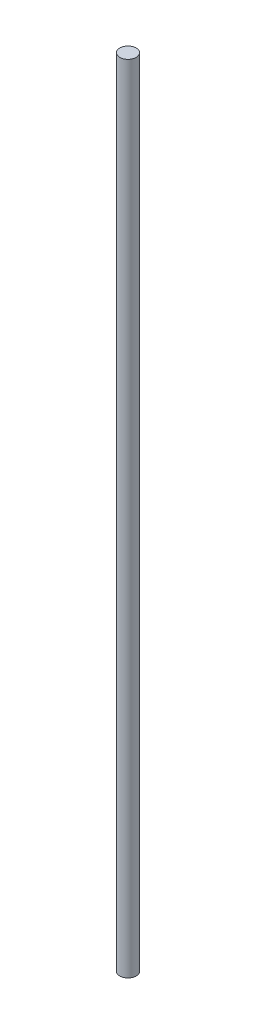
ISO-10303-21;
HEADER;
FILE_DESCRIPTION(('STEP AP214'),'2;1');
FILE_NAME('part.step','',(''),(''),'','','');
FILE_SCHEMA(('AUTOMOTIVE_DESIGN { 1 0 10303 214 1 1 1 1 }'));
ENDSEC;
DATA;
#1=APPLICATION_CONTEXT('core data for automotive mechanical design processes');
#2=APPLICATION_PROTOCOL_DEFINITION('international standard','automotive_design',2000,#1);
#3=PRODUCT_CONTEXT('',#1,'mechanical');
#4=PRODUCT('Part','Part','',(#3));
#5=PRODUCT_RELATED_PRODUCT_CATEGORY('part','',(#4));
#6=PRODUCT_DEFINITION_FORMATION('','',#4);
#7=PRODUCT_DEFINITION_CONTEXT('part definition',#1,'design');
#8=PRODUCT_DEFINITION('design','',#6,#7);
#9=PRODUCT_DEFINITION_SHAPE('','',#8);
#10=(LENGTH_UNIT() NAMED_UNIT(*) SI_UNIT(.MILLI.,.METRE.));
#11=(NAMED_UNIT(*) PLANE_ANGLE_UNIT() SI_UNIT($,.RADIAN.));
#12=(NAMED_UNIT(*) SI_UNIT($,.STERADIAN.) SOLID_ANGLE_UNIT());
#13=UNCERTAINTY_MEASURE_WITH_UNIT(LENGTH_MEASURE(1.E-05),#10,'distance_accuracy_value','');
#14=(GEOMETRIC_REPRESENTATION_CONTEXT(3) GLOBAL_UNCERTAINTY_ASSIGNED_CONTEXT((#13)) GLOBAL_UNIT_ASSIGNED_CONTEXT((#10,
#11,#12)) REPRESENTATION_CONTEXT('',''));
#15=CARTESIAN_POINT('',(0.,0.,0.));
#16=DIRECTION('',(0.,0.,1.));
#17=DIRECTION('',(1.,0.,0.));
#18=AXIS2_PLACEMENT_3D('',#15,#16,#17);
#19=CARTESIAN_POINT('',(0.,292.,0.));
#20=DIRECTION('',(0.,-1.,0.));
#21=DIRECTION('',(0.,0.,-1.));
#22=AXIS2_PLACEMENT_3D('',#19,#20,#21);
#23=CYLINDRICAL_SURFACE('',#22,3.);
#24=CARTESIAN_POINT('',(0.,292.,0.));
#25=DIRECTION('',(0.,1.,0.));
#26=DIRECTION('',(0.,0.,1.));
#27=AXIS2_PLACEMENT_3D('',#24,#25,#26);
#28=CIRCLE('',#27,3.);
#29=CARTESIAN_POINT('',(0.,292.,3.));
#30=VERTEX_POINT('',#29);
#31=EDGE_CURVE('E10',#30,#30,#28,.T.);
#32=ORIENTED_EDGE('',*,*,#31,.F.);
#33=EDGE_LOOP('',(#32));
#34=FACE_BOUND('',#33,.T.);
#35=CARTESIAN_POINT('',(0.,0.,0.));
#36=DIRECTION('',(0.,1.,0.));
#37=DIRECTION('',(0.,0.,1.));
#38=AXIS2_PLACEMENT_3D('',#35,#36,#37);
#39=CIRCLE('',#38,3.);
#40=CARTESIAN_POINT('',(0.,0.,3.));
#41=VERTEX_POINT('',#40);
#42=EDGE_CURVE('E34',#41,#41,#39,.T.);
#43=ORIENTED_EDGE('',*,*,#42,.T.);
#44=EDGE_LOOP('',(#43));
#45=FACE_BOUND('',#44,.T.);
#46=ADVANCED_FACE('F31',(#34,#45),#23,.T.);
#47=CARTESIAN_POINT('',(0.,292.,0.));
#48=DIRECTION('',(0.,1.,0.));
#49=DIRECTION('',(0.,0.,1.));
#50=AXIS2_PLACEMENT_3D('',#47,#48,#49);
#51=PLANE('',#50);
#52=ORIENTED_EDGE('',*,*,#31,.T.);
#53=EDGE_LOOP('',(#52));
#54=FACE_BOUND('',#53,.T.);
#55=ADVANCED_FACE('F46',(#54),#51,.T.);
#56=CARTESIAN_POINT('',(0.,0.,0.));
#57=DIRECTION('',(0.,1.,0.));
#58=DIRECTION('',(0.,0.,1.));
#59=AXIS2_PLACEMENT_3D('',#56,#57,#58);
#60=PLANE('',#59);
#61=ORIENTED_EDGE('',*,*,#42,.F.);
#62=EDGE_LOOP('',(#61));
#63=FACE_BOUND('',#62,.T.);
#64=ADVANCED_FACE('F44',(#63),#60,.F.);
#65=CLOSED_SHELL('',(#46,#55,#64));
#66=MANIFOLD_SOLID_BREP('B2',#65);
#67=ADVANCED_BREP_SHAPE_REPRESENTATION('',(#18,#66),#14);
#68=SHAPE_DEFINITION_REPRESENTATION(#9,#67);
ENDSEC;
END-ISO-10303-21;
